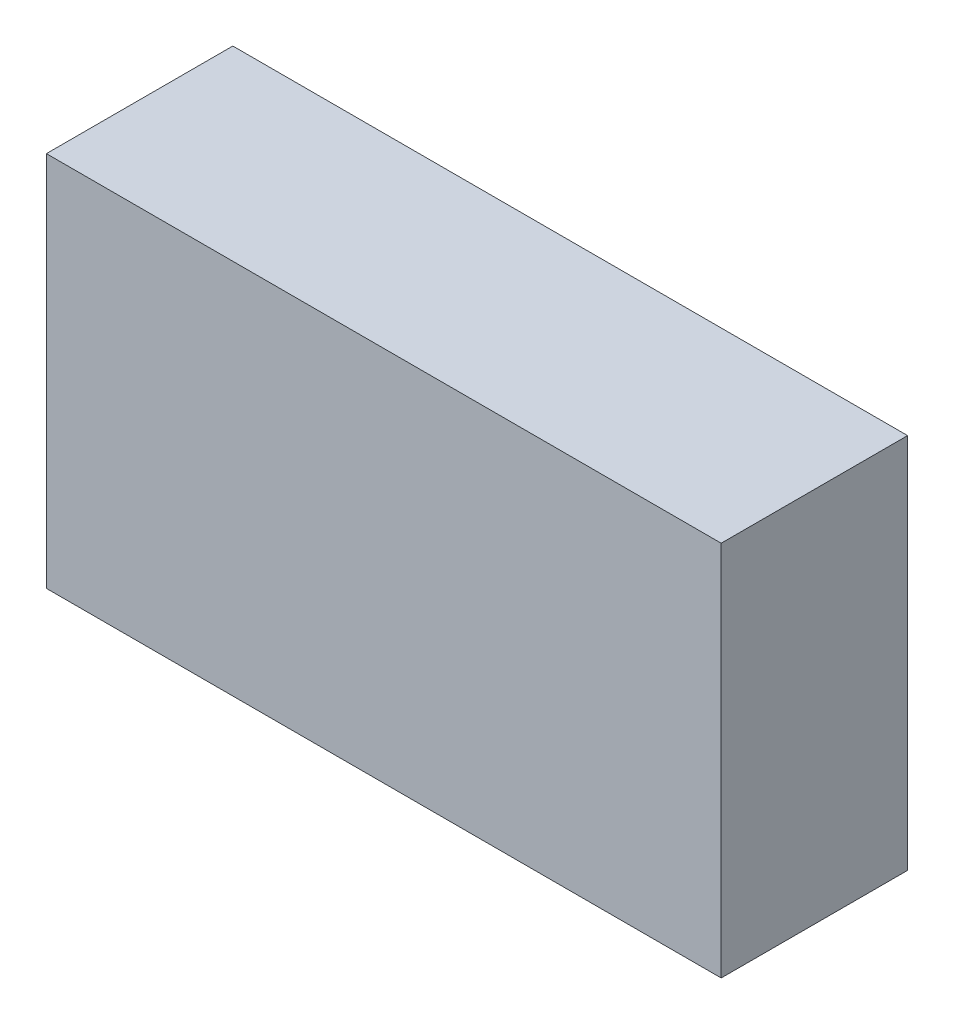
ISO-10303-21;
HEADER;
FILE_DESCRIPTION(('STEP AP214'),'2;1');
FILE_NAME('part.step','',(''),(''),'','','');
FILE_SCHEMA(('AUTOMOTIVE_DESIGN { 1 0 10303 214 1 1 1 1 }'));
ENDSEC;
DATA;
#1=APPLICATION_CONTEXT('core data for automotive mechanical design processes');
#2=APPLICATION_PROTOCOL_DEFINITION('international standard','automotive_design',2000,#1);
#3=PRODUCT_CONTEXT('',#1,'mechanical');
#4=PRODUCT('Part','Part','',(#3));
#5=PRODUCT_RELATED_PRODUCT_CATEGORY('part','',(#4));
#6=PRODUCT_DEFINITION_FORMATION('','',#4);
#7=PRODUCT_DEFINITION_CONTEXT('part definition',#1,'design');
#8=PRODUCT_DEFINITION('design','',#6,#7);
#9=PRODUCT_DEFINITION_SHAPE('','',#8);
#10=(LENGTH_UNIT() NAMED_UNIT(*) SI_UNIT(.MILLI.,.METRE.));
#11=(NAMED_UNIT(*) PLANE_ANGLE_UNIT() SI_UNIT($,.RADIAN.));
#12=(NAMED_UNIT(*) SI_UNIT($,.STERADIAN.) SOLID_ANGLE_UNIT());
#13=UNCERTAINTY_MEASURE_WITH_UNIT(LENGTH_MEASURE(1.E-05),#10,'distance_accuracy_value','');
#14=(GEOMETRIC_REPRESENTATION_CONTEXT(3) GLOBAL_UNCERTAINTY_ASSIGNED_CONTEXT((#13)) GLOBAL_UNIT_ASSIGNED_CONTEXT((#10,
#11,#12)) REPRESENTATION_CONTEXT('',''));
#15=CARTESIAN_POINT('',(0.,0.,0.));
#16=DIRECTION('',(0.,0.,1.));
#17=DIRECTION('',(1.,0.,0.));
#18=AXIS2_PLACEMENT_3D('',#15,#16,#17);
#19=CARTESIAN_POINT('',(-0.90499946,-0.50499772,0.499999));
#20=DIRECTION('',(0.,0.,1.));
#21=DIRECTION('',(1.,0.,0.));
#22=AXIS2_PLACEMENT_3D('',#19,#20,#21);
#23=PLANE('',#22);
#24=DIRECTION('',(-1.,0.,0.));
#25=VECTOR('',#24,1.);
#26=CARTESIAN_POINT('',(0.90499946,-0.50499772,0.499999));
#27=LINE('',#26,#25);
#28=CARTESIAN_POINT('',(0.90499946,-0.50499772,0.499999));
#29=VERTEX_POINT('',#28);
#30=CARTESIAN_POINT('',(-0.90499946,-0.50499772,0.499999));
#31=VERTEX_POINT('',#30);
#32=EDGE_CURVE('E26',#29,#31,#27,.T.);
#33=ORIENTED_EDGE('',*,*,#32,.F.);
#34=DIRECTION('',(0.,-1.,0.));
#35=VECTOR('',#34,1.);
#36=CARTESIAN_POINT('',(0.90499946,0.50499772,0.499999));
#37=LINE('',#36,#35);
#38=CARTESIAN_POINT('',(0.90499946,0.50499772,0.499999));
#39=VERTEX_POINT('',#38);
#40=EDGE_CURVE('E100',#39,#29,#37,.T.);
#41=ORIENTED_EDGE('',*,*,#40,.F.);
#42=DIRECTION('',(1.,0.,0.));
#43=VECTOR('',#42,1.);
#44=CARTESIAN_POINT('',(-0.90499946,0.50499772,0.499999));
#45=LINE('',#44,#43);
#46=CARTESIAN_POINT('',(-0.90499946,0.50499772,0.499999));
#47=VERTEX_POINT('',#46);
#48=EDGE_CURVE('E84',#47,#39,#45,.T.);
#49=ORIENTED_EDGE('',*,*,#48,.F.);
#50=DIRECTION('',(0.,1.,0.));
#51=VECTOR('',#50,1.);
#52=CARTESIAN_POINT('',(-0.90499946,-0.50499772,0.499999));
#53=LINE('',#52,#51);
#54=EDGE_CURVE('E87',#31,#47,#53,.T.);
#55=ORIENTED_EDGE('',*,*,#54,.F.);
#56=EDGE_LOOP('',(#33,#41,#49,#55));
#57=FACE_BOUND('',#56,.T.);
#58=ADVANCED_FACE('F17',(#57),#23,.T.);
#59=CARTESIAN_POINT('',(-0.90499946,-0.50499772,0.));
#60=DIRECTION('',(0.,0.,1.));
#61=DIRECTION('',(1.,0.,0.));
#62=AXIS2_PLACEMENT_3D('',#59,#60,#61);
#63=PLANE('',#62);
#64=DIRECTION('',(0.,1.,0.));
#65=VECTOR('',#64,1.);
#66=CARTESIAN_POINT('',(-0.90499946,-0.50499772,0.));
#67=LINE('',#66,#65);
#68=CARTESIAN_POINT('',(-0.90499946,-0.50499772,0.));
#69=VERTEX_POINT('',#68);
#70=CARTESIAN_POINT('',(-0.90499946,0.50499772,0.));
#71=VERTEX_POINT('',#70);
#72=EDGE_CURVE('E72',#69,#71,#67,.T.);
#73=ORIENTED_EDGE('',*,*,#72,.T.);
#74=DIRECTION('',(1.,0.,0.));
#75=VECTOR('',#74,1.);
#76=CARTESIAN_POINT('',(-0.90499946,0.50499772,0.));
#77=LINE('',#76,#75);
#78=CARTESIAN_POINT('',(0.90499946,0.50499772,0.));
#79=VERTEX_POINT('',#78);
#80=EDGE_CURVE('E103',#71,#79,#77,.T.);
#81=ORIENTED_EDGE('',*,*,#80,.T.);
#82=DIRECTION('',(0.,-1.,0.));
#83=VECTOR('',#82,1.);
#84=CARTESIAN_POINT('',(0.90499946,0.50499772,0.));
#85=LINE('',#84,#83);
#86=CARTESIAN_POINT('',(0.90499946,-0.50499772,0.));
#87=VERTEX_POINT('',#86);
#88=EDGE_CURVE('E74',#79,#87,#85,.T.);
#89=ORIENTED_EDGE('',*,*,#88,.T.);
#90=DIRECTION('',(-1.,0.,0.));
#91=VECTOR('',#90,1.);
#92=CARTESIAN_POINT('',(0.90499946,-0.50499772,0.));
#93=LINE('',#92,#91);
#94=EDGE_CURVE('E11',#87,#69,#93,.T.);
#95=ORIENTED_EDGE('',*,*,#94,.T.);
#96=EDGE_LOOP('',(#73,#81,#89,#95));
#97=FACE_BOUND('',#96,.T.);
#98=ADVANCED_FACE('F70',(#97),#63,.F.);
#99=CARTESIAN_POINT('',(0.90499946,-0.50499772,0.));
#100=DIRECTION('',(0.,-1.,0.));
#101=DIRECTION('',(0.,0.,-1.));
#102=AXIS2_PLACEMENT_3D('',#99,#100,#101);
#103=PLANE('',#102);
#104=DIRECTION('',(0.,0.,1.));
#105=VECTOR('',#104,1.);
#106=CARTESIAN_POINT('',(0.90499946,-0.50499772,0.));
#107=LINE('',#106,#105);
#108=EDGE_CURVE('E97',#87,#29,#107,.T.);
#109=ORIENTED_EDGE('',*,*,#108,.T.);
#110=ORIENTED_EDGE('',*,*,#32,.T.);
#111=DIRECTION('',(0.,0.,1.));
#112=VECTOR('',#111,1.);
#113=CARTESIAN_POINT('',(-0.90499946,-0.50499772,0.));
#114=LINE('',#113,#112);
#115=EDGE_CURVE('E80',#69,#31,#114,.T.);
#116=ORIENTED_EDGE('',*,*,#115,.F.);
#117=ORIENTED_EDGE('',*,*,#94,.F.);
#118=EDGE_LOOP('',(#109,#110,#116,#117));
#119=FACE_BOUND('',#118,.T.);
#120=ADVANCED_FACE('F19',(#119),#103,.T.);
#121=CARTESIAN_POINT('',(0.90499946,0.50499772,0.));
#122=DIRECTION('',(1.,0.,0.));
#123=DIRECTION('',(0.,1.,0.));
#124=AXIS2_PLACEMENT_3D('',#121,#122,#123);
#125=PLANE('',#124);
#126=DIRECTION('',(0.,0.,1.));
#127=VECTOR('',#126,1.);
#128=CARTESIAN_POINT('',(0.90499946,0.50499772,0.));
#129=LINE('',#128,#127);
#130=EDGE_CURVE('E110',#79,#39,#129,.T.);
#131=ORIENTED_EDGE('',*,*,#130,.T.);
#132=ORIENTED_EDGE('',*,*,#40,.T.);
#133=ORIENTED_EDGE('',*,*,#108,.F.);
#134=ORIENTED_EDGE('',*,*,#88,.F.);
#135=EDGE_LOOP('',(#131,#132,#133,#134));
#136=FACE_BOUND('',#135,.T.);
#137=ADVANCED_FACE('F170',(#136),#125,.T.);
#138=CARTESIAN_POINT('',(-0.90499946,0.50499772,0.));
#139=DIRECTION('',(0.,1.,0.));
#140=DIRECTION('',(1.,0.,0.));
#141=AXIS2_PLACEMENT_3D('',#138,#139,#140);
#142=PLANE('',#141);
#143=DIRECTION('',(0.,0.,1.));
#144=VECTOR('',#143,1.);
#145=CARTESIAN_POINT('',(-0.90499946,0.50499772,0.));
#146=LINE('',#145,#144);
#147=EDGE_CURVE('E82',#71,#47,#146,.T.);
#148=ORIENTED_EDGE('',*,*,#147,.T.);
#149=ORIENTED_EDGE('',*,*,#48,.T.);
#150=ORIENTED_EDGE('',*,*,#130,.F.);
#151=ORIENTED_EDGE('',*,*,#80,.F.);
#152=EDGE_LOOP('',(#148,#149,#150,#151));
#153=FACE_BOUND('',#152,.T.);
#154=ADVANCED_FACE('F159',(#153),#142,.T.);
#155=CARTESIAN_POINT('',(-0.90499946,-0.50499772,0.));
#156=DIRECTION('',(-1.,0.,0.));
#157=DIRECTION('',(0.,0.,1.));
#158=AXIS2_PLACEMENT_3D('',#155,#156,#157);
#159=PLANE('',#158);
#160=ORIENTED_EDGE('',*,*,#115,.T.);
#161=ORIENTED_EDGE('',*,*,#54,.T.);
#162=ORIENTED_EDGE('',*,*,#147,.F.);
#163=ORIENTED_EDGE('',*,*,#72,.F.);
#164=EDGE_LOOP('',(#160,#161,#162,#163));
#165=FACE_BOUND('',#164,.T.);
#166=ADVANCED_FACE('F78',(#165),#159,.T.);
#167=CLOSED_SHELL('',(#58,#98,#120,#137,#154,#166));
#168=MANIFOLD_SOLID_BREP('B1',#167);
#169=ADVANCED_BREP_SHAPE_REPRESENTATION('',(#18,#168),#14);
#170=SHAPE_DEFINITION_REPRESENTATION(#9,#169);
ENDSEC;
END-ISO-10303-21;
